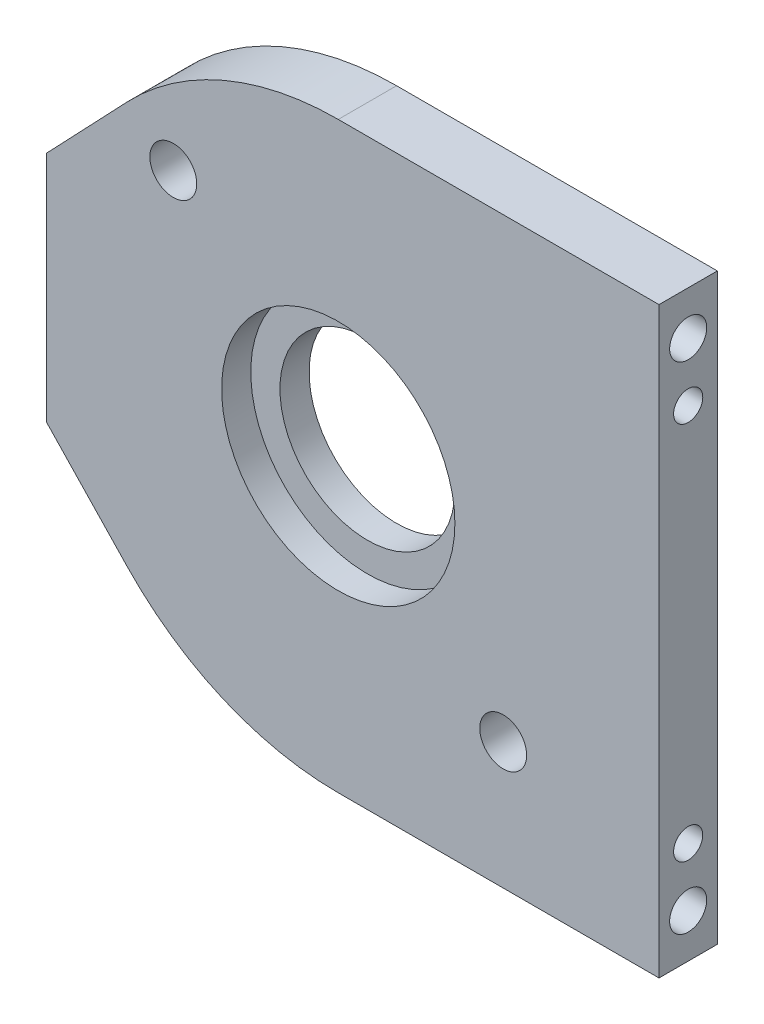
ISO-10303-21;
HEADER;
FILE_DESCRIPTION(('STEP AP214'),'2;1');
FILE_NAME('part.step','',(''),(''),'','','');
FILE_SCHEMA(('AUTOMOTIVE_DESIGN { 1 0 10303 214 1 1 1 1 }'));
ENDSEC;
DATA;
#1=APPLICATION_CONTEXT('core data for automotive mechanical design processes');
#2=APPLICATION_PROTOCOL_DEFINITION('international standard','automotive_design',2000,#1);
#3=PRODUCT_CONTEXT('',#1,'mechanical');
#4=PRODUCT('Part','Part','',(#3));
#5=PRODUCT_RELATED_PRODUCT_CATEGORY('part','',(#4));
#6=PRODUCT_DEFINITION_FORMATION('','',#4);
#7=PRODUCT_DEFINITION_CONTEXT('part definition',#1,'design');
#8=PRODUCT_DEFINITION('design','',#6,#7);
#9=PRODUCT_DEFINITION_SHAPE('','',#8);
#10=(LENGTH_UNIT() NAMED_UNIT(*) SI_UNIT(.MILLI.,.METRE.));
#11=(NAMED_UNIT(*) PLANE_ANGLE_UNIT() SI_UNIT($,.RADIAN.));
#12=(NAMED_UNIT(*) SI_UNIT($,.STERADIAN.) SOLID_ANGLE_UNIT());
#13=UNCERTAINTY_MEASURE_WITH_UNIT(LENGTH_MEASURE(1.E-05),#10,'distance_accuracy_value','');
#14=(GEOMETRIC_REPRESENTATION_CONTEXT(3) GLOBAL_UNCERTAINTY_ASSIGNED_CONTEXT((#13)) GLOBAL_UNIT_ASSIGNED_CONTEXT((#10,
#11,#12)) REPRESENTATION_CONTEXT('',''));
#15=CARTESIAN_POINT('',(0.,0.,0.));
#16=DIRECTION('',(0.,0.,1.));
#17=DIRECTION('',(1.,0.,0.));
#18=AXIS2_PLACEMENT_3D('',#15,#16,#17);
#19=CARTESIAN_POINT('',(0.,0.,6.35));
#20=DIRECTION('',(0.,0.,-1.));
#21=DIRECTION('',(-1.,0.,0.));
#22=AXIS2_PLACEMENT_3D('',#19,#20,#21);
#23=CYLINDRICAL_SURFACE('',#22,9.525);
#24=CARTESIAN_POINT('',(0.,0.,0.));
#25=DIRECTION('',(0.,0.,1.));
#26=DIRECTION('',(1.,0.,0.));
#27=AXIS2_PLACEMENT_3D('',#24,#25,#26);
#28=CIRCLE('',#27,9.525);
#29=CARTESIAN_POINT('',(9.525,0.,0.));
#30=VERTEX_POINT('',#29);
#31=EDGE_CURVE('E142',#30,#30,#28,.T.);
#32=ORIENTED_EDGE('',*,*,#31,.F.);
#33=EDGE_LOOP('',(#32));
#34=FACE_BOUND('',#33,.T.);
#35=CARTESIAN_POINT('',(0.,0.,3.175));
#36=DIRECTION('',(0.,0.,1.));
#37=DIRECTION('',(1.,0.,0.));
#38=AXIS2_PLACEMENT_3D('',#35,#36,#37);
#39=CIRCLE('',#38,9.525);
#40=CARTESIAN_POINT('',(9.525,0.,3.175));
#41=VERTEX_POINT('',#40);
#42=EDGE_CURVE('E41',#41,#41,#39,.T.);
#43=ORIENTED_EDGE('',*,*,#42,.T.);
#44=EDGE_LOOP('',(#43));
#45=FACE_BOUND('',#44,.T.);
#46=ADVANCED_FACE('F37',(#34,#45),#23,.F.);
#47=CARTESIAN_POINT('',(0.,0.,6.35));
#48=DIRECTION('',(0.,0.,1.));
#49=DIRECTION('',(1.,0.,0.));
#50=AXIS2_PLACEMENT_3D('',#47,#48,#49);
#51=PLANE('',#50);
#52=CARTESIAN_POINT('',(0.,0.,6.35));
#53=DIRECTION('',(0.,0.,1.));
#54=DIRECTION('',(1.,0.,0.));
#55=AXIS2_PLACEMENT_3D('',#52,#53,#54);
#56=CIRCLE('',#55,12.7);
#57=CARTESIAN_POINT('',(12.7,0.,6.35));
#58=VERTEX_POINT('',#57);
#59=EDGE_CURVE('E214',#58,#58,#56,.T.);
#60=ORIENTED_EDGE('',*,*,#59,.F.);
#61=EDGE_LOOP('',(#60));
#62=FACE_BOUND('',#61,.T.);
#63=CARTESIAN_POINT('',(-17.9605122421383,17.9605122421383,6.35));
#64=DIRECTION('',(0.,0.,1.));
#65=DIRECTION('',(1.,0.,0.));
#66=AXIS2_PLACEMENT_3D('',#63,#64,#65);
#67=CIRCLE('',#66,2.55269999999999);
#68=CARTESIAN_POINT('',(-15.4078122421383,17.9605122421383,6.35));
#69=VERTEX_POINT('',#68);
#70=EDGE_CURVE('E199',#69,#69,#67,.T.);
#71=ORIENTED_EDGE('',*,*,#70,.F.);
#72=EDGE_LOOP('',(#71));
#73=FACE_BOUND('',#72,.T.);
#74=CARTESIAN_POINT('',(17.9605122421383,-17.9605122421383,6.35));
#75=DIRECTION('',(0.,0.,1.));
#76=DIRECTION('',(1.,0.,0.));
#77=AXIS2_PLACEMENT_3D('',#74,#75,#76);
#78=CIRCLE('',#77,2.55269999999999);
#79=CARTESIAN_POINT('',(20.5132122421383,-17.9605122421383,6.35));
#80=VERTEX_POINT('',#79);
#81=EDGE_CURVE('E193',#80,#80,#78,.T.);
#82=ORIENTED_EDGE('',*,*,#81,.F.);
#83=EDGE_LOOP('',(#82));
#84=FACE_BOUND('',#83,.T.);
#85=CARTESIAN_POINT('',(0.,0.,6.35));
#86=DIRECTION('',(0.,0.,1.));
#87=DIRECTION('',(1.,0.,0.));
#88=AXIS2_PLACEMENT_3D('',#85,#86,#87);
#89=CIRCLE('',#88,31.75);
#90=CARTESIAN_POINT('',(0.,31.75,6.35));
#91=VERTEX_POINT('',#90);
#92=CARTESIAN_POINT('',(-22.9913793103449,21.8965517241379,6.35));
#93=VERTEX_POINT('',#92);
#94=EDGE_CURVE('E153',#91,#93,#89,.T.);
#95=ORIENTED_EDGE('',*,*,#94,.T.);
#96=DIRECTION('',(-0.689655172413792,-0.724137931034483,0.));
#97=VECTOR('',#96,1.);
#98=CARTESIAN_POINT('',(-22.9913793103449,21.8965517241379,6.35));
#99=LINE('',#98,#97);
#100=CARTESIAN_POINT('',(-31.75,12.7,6.35));
#101=VERTEX_POINT('',#100);
#102=EDGE_CURVE('E99',#93,#101,#99,.T.);
#103=ORIENTED_EDGE('',*,*,#102,.T.);
#104=DIRECTION('',(0.,-1.,0.));
#105=VECTOR('',#104,1.);
#106=CARTESIAN_POINT('',(-31.75,12.7,6.35));
#107=LINE('',#106,#105);
#108=CARTESIAN_POINT('',(-31.75,-12.7,6.35));
#109=VERTEX_POINT('',#108);
#110=EDGE_CURVE('E169',#101,#109,#107,.T.);
#111=ORIENTED_EDGE('',*,*,#110,.T.);
#112=DIRECTION('',(0.689655172413793,-0.724137931034483,0.));
#113=VECTOR('',#112,1.);
#114=CARTESIAN_POINT('',(-31.75,-12.7,6.35));
#115=LINE('',#114,#113);
#116=CARTESIAN_POINT('',(-22.9913793103448,-21.8965517241379,6.35));
#117=VERTEX_POINT('',#116);
#118=EDGE_CURVE('E182',#109,#117,#115,.T.);
#119=ORIENTED_EDGE('',*,*,#118,.T.);
#120=CARTESIAN_POINT('',(0.,0.,6.35));
#121=DIRECTION('',(0.,0.,1.));
#122=DIRECTION('',(1.,0.,0.));
#123=AXIS2_PLACEMENT_3D('',#120,#121,#122);
#124=CIRCLE('',#123,31.75);
#125=CARTESIAN_POINT('',(0.,-31.75,6.35));
#126=VERTEX_POINT('',#125);
#127=EDGE_CURVE('E120',#117,#126,#124,.T.);
#128=ORIENTED_EDGE('',*,*,#127,.T.);
#129=DIRECTION('',(1.,0.,0.));
#130=VECTOR('',#129,1.);
#131=CARTESIAN_POINT('',(34.925,-31.75,6.35));
#132=LINE('',#131,#130);
#133=CARTESIAN_POINT('',(34.925,-31.75,6.35));
#134=VERTEX_POINT('',#133);
#135=EDGE_CURVE('E114',#126,#134,#132,.T.);
#136=ORIENTED_EDGE('',*,*,#135,.T.);
#137=DIRECTION('',(0.,1.,0.));
#138=VECTOR('',#137,1.);
#139=CARTESIAN_POINT('',(34.925,31.75,6.35));
#140=LINE('',#139,#138);
#141=CARTESIAN_POINT('',(34.925,31.75,6.35));
#142=VERTEX_POINT('',#141);
#143=EDGE_CURVE('E118',#134,#142,#140,.T.);
#144=ORIENTED_EDGE('',*,*,#143,.T.);
#145=DIRECTION('',(-1.,0.,0.));
#146=VECTOR('',#145,1.);
#147=CARTESIAN_POINT('',(34.925,31.75,6.35));
#148=LINE('',#147,#146);
#149=EDGE_CURVE('E55',#142,#91,#148,.T.);
#150=ORIENTED_EDGE('',*,*,#149,.T.);
#151=EDGE_LOOP('',(#95,#103,#111,#119,#128,#136,#144,#150));
#152=FACE_BOUND('',#151,.T.);
#153=ADVANCED_FACE('F116',(#62,#73,#84,#152),#51,.T.);
#154=CARTESIAN_POINT('',(0.,0.,0.));
#155=DIRECTION('',(0.,0.,1.));
#156=DIRECTION('',(1.,0.,0.));
#157=AXIS2_PLACEMENT_3D('',#154,#155,#156);
#158=PLANE('',#157);
#159=CARTESIAN_POINT('',(-17.9605122421383,17.9605122421383,0.));
#160=DIRECTION('',(0.,0.,1.));
#161=DIRECTION('',(1.,0.,0.));
#162=AXIS2_PLACEMENT_3D('',#159,#160,#161);
#163=CIRCLE('',#162,2.5527);
#164=CARTESIAN_POINT('',(-15.4078122421383,17.9605122421383,0.));
#165=VERTEX_POINT('',#164);
#166=EDGE_CURVE('E196',#165,#165,#163,.T.);
#167=ORIENTED_EDGE('',*,*,#166,.T.);
#168=EDGE_LOOP('',(#167));
#169=FACE_BOUND('',#168,.T.);
#170=CARTESIAN_POINT('',(17.9605122421383,-17.9605122421383,0.));
#171=DIRECTION('',(0.,0.,1.));
#172=DIRECTION('',(1.,0.,0.));
#173=AXIS2_PLACEMENT_3D('',#170,#171,#172);
#174=CIRCLE('',#173,2.5527);
#175=CARTESIAN_POINT('',(20.5132122421383,-17.9605122421383,0.));
#176=VERTEX_POINT('',#175);
#177=EDGE_CURVE('E190',#176,#176,#174,.T.);
#178=ORIENTED_EDGE('',*,*,#177,.T.);
#179=EDGE_LOOP('',(#178));
#180=FACE_BOUND('',#179,.T.);
#181=CARTESIAN_POINT('',(0.,0.,0.));
#182=DIRECTION('',(0.,0.,1.));
#183=DIRECTION('',(1.,0.,0.));
#184=AXIS2_PLACEMENT_3D('',#181,#182,#183);
#185=CIRCLE('',#184,31.75);
#186=CARTESIAN_POINT('',(0.,31.75,0.));
#187=VERTEX_POINT('',#186);
#188=CARTESIAN_POINT('',(-22.9913793103449,21.8965517241379,0.));
#189=VERTEX_POINT('',#188);
#190=EDGE_CURVE('E138',#187,#189,#185,.T.);
#191=ORIENTED_EDGE('',*,*,#190,.F.);
#192=DIRECTION('',(-1.,0.,0.));
#193=VECTOR('',#192,1.);
#194=CARTESIAN_POINT('',(34.925,31.75,0.));
#195=LINE('',#194,#193);
#196=CARTESIAN_POINT('',(34.925,31.75,0.));
#197=VERTEX_POINT('',#196);
#198=EDGE_CURVE('E91',#197,#187,#195,.T.);
#199=ORIENTED_EDGE('',*,*,#198,.F.);
#200=DIRECTION('',(0.,1.,0.));
#201=VECTOR('',#200,1.);
#202=CARTESIAN_POINT('',(34.925,31.75,0.));
#203=LINE('',#202,#201);
#204=CARTESIAN_POINT('',(34.925,-31.75,0.));
#205=VERTEX_POINT('',#204);
#206=EDGE_CURVE('E85',#205,#197,#203,.T.);
#207=ORIENTED_EDGE('',*,*,#206,.F.);
#208=DIRECTION('',(1.,0.,0.));
#209=VECTOR('',#208,1.);
#210=CARTESIAN_POINT('',(34.925,-31.75,0.));
#211=LINE('',#210,#209);
#212=CARTESIAN_POINT('',(0.,-31.75,0.));
#213=VERTEX_POINT('',#212);
#214=EDGE_CURVE('E128',#213,#205,#211,.T.);
#215=ORIENTED_EDGE('',*,*,#214,.F.);
#216=CARTESIAN_POINT('',(0.,0.,0.));
#217=DIRECTION('',(0.,0.,1.));
#218=DIRECTION('',(1.,0.,0.));
#219=AXIS2_PLACEMENT_3D('',#216,#217,#218);
#220=CIRCLE('',#219,31.75);
#221=CARTESIAN_POINT('',(-22.9913793103448,-21.8965517241379,0.));
#222=VERTEX_POINT('',#221);
#223=EDGE_CURVE('E148',#222,#213,#220,.T.);
#224=ORIENTED_EDGE('',*,*,#223,.F.);
#225=DIRECTION('',(0.689655172413793,-0.724137931034483,0.));
#226=VECTOR('',#225,1.);
#227=CARTESIAN_POINT('',(-31.75,-12.7,0.));
#228=LINE('',#227,#226);
#229=CARTESIAN_POINT('',(-31.75,-12.7,0.));
#230=VERTEX_POINT('',#229);
#231=EDGE_CURVE('E146',#230,#222,#228,.T.);
#232=ORIENTED_EDGE('',*,*,#231,.F.);
#233=DIRECTION('',(0.,-1.,0.));
#234=VECTOR('',#233,1.);
#235=CARTESIAN_POINT('',(-31.75,12.7,0.));
#236=LINE('',#235,#234);
#237=CARTESIAN_POINT('',(-31.75,12.7,0.));
#238=VERTEX_POINT('',#237);
#239=EDGE_CURVE('E144',#238,#230,#236,.T.);
#240=ORIENTED_EDGE('',*,*,#239,.F.);
#241=DIRECTION('',(-0.689655172413792,-0.724137931034483,0.));
#242=VECTOR('',#241,1.);
#243=CARTESIAN_POINT('',(-22.9913793103449,21.8965517241379,0.));
#244=LINE('',#243,#242);
#245=EDGE_CURVE('E141',#189,#238,#244,.T.);
#246=ORIENTED_EDGE('',*,*,#245,.F.);
#247=EDGE_LOOP('',(#191,#199,#207,#215,#224,#232,#240,#246));
#248=FACE_BOUND('',#247,.T.);
#249=ORIENTED_EDGE('',*,*,#31,.T.);
#250=EDGE_LOOP('',(#249));
#251=FACE_BOUND('',#250,.T.);
#252=ADVANCED_FACE('F173',(#169,#180,#248,#251),#158,.F.);
#253=CARTESIAN_POINT('',(0.,0.,6.35));
#254=DIRECTION('',(0.,0.,-1.));
#255=DIRECTION('',(-1.,0.,0.));
#256=AXIS2_PLACEMENT_3D('',#253,#254,#255);
#257=CYLINDRICAL_SURFACE('',#256,31.75);
#258=ORIENTED_EDGE('',*,*,#190,.T.);
#259=DIRECTION('',(0.,0.,-1.));
#260=VECTOR('',#259,1.);
#261=CARTESIAN_POINT('',(-22.9913793103449,21.8965517241379,6.35));
#262=LINE('',#261,#260);
#263=EDGE_CURVE('E11',#93,#189,#262,.T.);
#264=ORIENTED_EDGE('',*,*,#263,.F.);
#265=ORIENTED_EDGE('',*,*,#94,.F.);
#266=DIRECTION('',(0.,0.,-1.));
#267=VECTOR('',#266,1.);
#268=CARTESIAN_POINT('',(0.,31.75,6.35));
#269=LINE('',#268,#267);
#270=EDGE_CURVE('E134',#91,#187,#269,.T.);
#271=ORIENTED_EDGE('',*,*,#270,.T.);
#272=EDGE_LOOP('',(#258,#264,#265,#271));
#273=FACE_BOUND('',#272,.T.);
#274=ADVANCED_FACE('F39',(#273),#257,.T.);
#275=CARTESIAN_POINT('',(-22.9913793103449,21.8965517241379,6.35));
#276=DIRECTION('',(0.724137931034483,-0.689655172413792,0.));
#277=DIRECTION('',(0.689655172413792,0.724137931034483,0.));
#278=AXIS2_PLACEMENT_3D('',#275,#276,#277);
#279=PLANE('',#278);
#280=ORIENTED_EDGE('',*,*,#245,.T.);
#281=DIRECTION('',(0.,0.,-1.));
#282=VECTOR('',#281,1.);
#283=CARTESIAN_POINT('',(-31.75,12.7,6.35));
#284=LINE('',#283,#282);
#285=EDGE_CURVE('E47',#101,#238,#284,.T.);
#286=ORIENTED_EDGE('',*,*,#285,.F.);
#287=ORIENTED_EDGE('',*,*,#102,.F.);
#288=ORIENTED_EDGE('',*,*,#263,.T.);
#289=EDGE_LOOP('',(#280,#286,#287,#288));
#290=FACE_BOUND('',#289,.T.);
#291=ADVANCED_FACE('F255',(#290),#279,.F.);
#292=CARTESIAN_POINT('',(-31.75,12.7,6.35));
#293=DIRECTION('',(1.,0.,0.));
#294=DIRECTION('',(0.,1.,0.));
#295=AXIS2_PLACEMENT_3D('',#292,#293,#294);
#296=PLANE('',#295);
#297=CARTESIAN_POINT('',(-31.75,0.,3.175));
#298=DIRECTION('',(-1.,0.,0.));
#299=DIRECTION('',(0.,0.,1.));
#300=AXIS2_PLACEMENT_3D('',#297,#298,#299);
#301=CIRCLE('',#300,2.0193);
#302=CARTESIAN_POINT('',(-31.75,0.,5.1943));
#303=VERTEX_POINT('',#302);
#304=EDGE_CURVE('E247',#303,#303,#301,.T.);
#305=ORIENTED_EDGE('',*,*,#304,.F.);
#306=EDGE_LOOP('',(#305));
#307=FACE_BOUND('',#306,.T.);
#308=CARTESIAN_POINT('',(-31.75,7.93749999999999,3.175));
#309=DIRECTION('',(-1.,0.,0.));
#310=DIRECTION('',(0.,0.,1.));
#311=AXIS2_PLACEMENT_3D('',#308,#309,#310);
#312=CIRCLE('',#311,1.5875);
#313=CARTESIAN_POINT('',(-31.75,7.93749999999999,4.7625));
#314=VERTEX_POINT('',#313);
#315=EDGE_CURVE('E241',#314,#314,#312,.T.);
#316=ORIENTED_EDGE('',*,*,#315,.F.);
#317=EDGE_LOOP('',(#316));
#318=FACE_BOUND('',#317,.T.);
#319=CARTESIAN_POINT('',(-31.75,-7.93750000000001,3.175));
#320=DIRECTION('',(-1.,0.,0.));
#321=DIRECTION('',(0.,0.,1.));
#322=AXIS2_PLACEMENT_3D('',#319,#320,#321);
#323=CIRCLE('',#322,1.5875);
#324=CARTESIAN_POINT('',(-31.75,-7.93750000000001,4.7625));
#325=VERTEX_POINT('',#324);
#326=EDGE_CURVE('E235',#325,#325,#323,.T.);
#327=ORIENTED_EDGE('',*,*,#326,.F.);
#328=EDGE_LOOP('',(#327));
#329=FACE_BOUND('',#328,.T.);
#330=ORIENTED_EDGE('',*,*,#239,.T.);
#331=DIRECTION('',(0.,0.,-1.));
#332=VECTOR('',#331,1.);
#333=CARTESIAN_POINT('',(-31.75,-12.7,6.35));
#334=LINE('',#333,#332);
#335=EDGE_CURVE('E160',#109,#230,#334,.T.);
#336=ORIENTED_EDGE('',*,*,#335,.F.);
#337=ORIENTED_EDGE('',*,*,#110,.F.);
#338=ORIENTED_EDGE('',*,*,#285,.T.);
#339=EDGE_LOOP('',(#330,#336,#337,#338));
#340=FACE_BOUND('',#339,.T.);
#341=ADVANCED_FACE('F167',(#307,#318,#329,#340),#296,.F.);
#342=CARTESIAN_POINT('',(-31.75,-12.7,6.35));
#343=DIRECTION('',(0.724137931034483,0.689655172413793,0.));
#344=DIRECTION('',(-0.689655172413793,0.724137931034483,0.));
#345=AXIS2_PLACEMENT_3D('',#342,#343,#344);
#346=PLANE('',#345);
#347=ORIENTED_EDGE('',*,*,#231,.T.);
#348=DIRECTION('',(0.,0.,-1.));
#349=VECTOR('',#348,1.);
#350=CARTESIAN_POINT('',(-22.9913793103448,-21.8965517241379,6.35));
#351=LINE('',#350,#349);
#352=EDGE_CURVE('E157',#117,#222,#351,.T.);
#353=ORIENTED_EDGE('',*,*,#352,.F.);
#354=ORIENTED_EDGE('',*,*,#118,.F.);
#355=ORIENTED_EDGE('',*,*,#335,.T.);
#356=EDGE_LOOP('',(#347,#353,#354,#355));
#357=FACE_BOUND('',#356,.T.);
#358=ADVANCED_FACE('F178',(#357),#346,.F.);
#359=CARTESIAN_POINT('',(0.,0.,6.35));
#360=DIRECTION('',(0.,0.,-1.));
#361=DIRECTION('',(-1.,0.,0.));
#362=AXIS2_PLACEMENT_3D('',#359,#360,#361);
#363=CYLINDRICAL_SURFACE('',#362,31.75);
#364=ORIENTED_EDGE('',*,*,#223,.T.);
#365=DIRECTION('',(0.,0.,-1.));
#366=VECTOR('',#365,1.);
#367=CARTESIAN_POINT('',(0.,-31.75,6.35));
#368=LINE('',#367,#366);
#369=EDGE_CURVE('E129',#126,#213,#368,.T.);
#370=ORIENTED_EDGE('',*,*,#369,.F.);
#371=ORIENTED_EDGE('',*,*,#127,.F.);
#372=ORIENTED_EDGE('',*,*,#352,.T.);
#373=EDGE_LOOP('',(#364,#370,#371,#372));
#374=FACE_BOUND('',#373,.T.);
#375=ADVANCED_FACE('F181',(#374),#363,.T.);
#376=CARTESIAN_POINT('',(34.925,-31.75,6.35));
#377=DIRECTION('',(0.,1.,0.));
#378=DIRECTION('',(-1.,0.,0.));
#379=AXIS2_PLACEMENT_3D('',#376,#377,#378);
#380=PLANE('',#379);
#381=ORIENTED_EDGE('',*,*,#214,.T.);
#382=DIRECTION('',(0.,0.,-1.));
#383=VECTOR('',#382,1.);
#384=CARTESIAN_POINT('',(34.925,-31.75,6.35));
#385=LINE('',#384,#383);
#386=EDGE_CURVE('E125',#134,#205,#385,.T.);
#387=ORIENTED_EDGE('',*,*,#386,.F.);
#388=ORIENTED_EDGE('',*,*,#135,.F.);
#389=ORIENTED_EDGE('',*,*,#369,.T.);
#390=EDGE_LOOP('',(#381,#387,#388,#389));
#391=FACE_BOUND('',#390,.T.);
#392=ADVANCED_FACE('F126',(#391),#380,.F.);
#393=CARTESIAN_POINT('',(34.925,31.75,6.35));
#394=DIRECTION('',(-1.,0.,0.));
#395=DIRECTION('',(0.,-1.,0.));
#396=AXIS2_PLACEMENT_3D('',#393,#394,#395);
#397=PLANE('',#396);
#398=CARTESIAN_POINT('',(34.925,26.9875,3.175));
#399=DIRECTION('',(1.,0.,0.));
#400=DIRECTION('',(0.,0.,-1.));
#401=AXIS2_PLACEMENT_3D('',#398,#399,#400);
#402=CIRCLE('',#401,2.0193);
#403=CARTESIAN_POINT('',(34.925,26.9875,1.1557));
#404=VERTEX_POINT('',#403);
#405=EDGE_CURVE('E229',#404,#404,#402,.T.);
#406=ORIENTED_EDGE('',*,*,#405,.F.);
#407=EDGE_LOOP('',(#406));
#408=FACE_BOUND('',#407,.T.);
#409=CARTESIAN_POINT('',(34.925,-26.9875,3.175));
#410=DIRECTION('',(1.,0.,0.));
#411=DIRECTION('',(0.,0.,-1.));
#412=AXIS2_PLACEMENT_3D('',#409,#410,#411);
#413=CIRCLE('',#412,2.0193);
#414=CARTESIAN_POINT('',(34.925,-26.9875,1.1557));
#415=VERTEX_POINT('',#414);
#416=EDGE_CURVE('E223',#415,#415,#413,.T.);
#417=ORIENTED_EDGE('',*,*,#416,.F.);
#418=EDGE_LOOP('',(#417));
#419=FACE_BOUND('',#418,.T.);
#420=CARTESIAN_POINT('',(34.925,20.6375,3.175));
#421=DIRECTION('',(1.,0.,0.));
#422=DIRECTION('',(0.,0.,-1.));
#423=AXIS2_PLACEMENT_3D('',#420,#421,#422);
#424=CIRCLE('',#423,1.58749999999999);
#425=CARTESIAN_POINT('',(34.925,20.6375,1.58750000000001));
#426=VERTEX_POINT('',#425);
#427=EDGE_CURVE('E211',#426,#426,#424,.T.);
#428=ORIENTED_EDGE('',*,*,#427,.F.);
#429=EDGE_LOOP('',(#428));
#430=FACE_BOUND('',#429,.T.);
#431=CARTESIAN_POINT('',(34.925,-20.6375,3.175));
#432=DIRECTION('',(1.,0.,0.));
#433=DIRECTION('',(0.,0.,-1.));
#434=AXIS2_PLACEMENT_3D('',#431,#432,#433);
#435=CIRCLE('',#434,1.58749999999999);
#436=CARTESIAN_POINT('',(34.925,-20.6375,1.58750000000001));
#437=VERTEX_POINT('',#436);
#438=EDGE_CURVE('E205',#437,#437,#435,.T.);
#439=ORIENTED_EDGE('',*,*,#438,.F.);
#440=EDGE_LOOP('',(#439));
#441=FACE_BOUND('',#440,.T.);
#442=ORIENTED_EDGE('',*,*,#206,.T.);
#443=DIRECTION('',(0.,0.,-1.));
#444=VECTOR('',#443,1.);
#445=CARTESIAN_POINT('',(34.925,31.75,6.35));
#446=LINE('',#445,#444);
#447=EDGE_CURVE('E130',#142,#197,#446,.T.);
#448=ORIENTED_EDGE('',*,*,#447,.F.);
#449=ORIENTED_EDGE('',*,*,#143,.F.);
#450=ORIENTED_EDGE('',*,*,#386,.T.);
#451=EDGE_LOOP('',(#442,#448,#449,#450));
#452=FACE_BOUND('',#451,.T.);
#453=ADVANCED_FACE('F132',(#408,#419,#430,#441,#452),#397,.F.);
#454=CARTESIAN_POINT('',(34.925,31.75,6.35));
#455=DIRECTION('',(0.,-1.,0.));
#456=DIRECTION('',(0.,0.,-1.));
#457=AXIS2_PLACEMENT_3D('',#454,#455,#456);
#458=PLANE('',#457);
#459=ORIENTED_EDGE('',*,*,#198,.T.);
#460=ORIENTED_EDGE('',*,*,#270,.F.);
#461=ORIENTED_EDGE('',*,*,#149,.F.);
#462=ORIENTED_EDGE('',*,*,#447,.T.);
#463=EDGE_LOOP('',(#459,#460,#461,#462));
#464=FACE_BOUND('',#463,.T.);
#465=ADVANCED_FACE('F295',(#464),#458,.F.);
#466=CARTESIAN_POINT('',(17.9605122421383,-17.9605122421383,6.35));
#467=DIRECTION('',(0.,0.,1.));
#468=DIRECTION('',(1.,0.,0.));
#469=AXIS2_PLACEMENT_3D('',#466,#467,#468);
#470=CYLINDRICAL_SURFACE('',#469,2.55269999999999);
#471=ORIENTED_EDGE('',*,*,#177,.F.);
#472=EDGE_LOOP('',(#471));
#473=FACE_BOUND('',#472,.T.);
#474=ORIENTED_EDGE('',*,*,#81,.T.);
#475=EDGE_LOOP('',(#474));
#476=FACE_BOUND('',#475,.T.);
#477=ADVANCED_FACE('F289',(#473,#476),#470,.F.);
#478=CARTESIAN_POINT('',(-17.9605122421383,17.9605122421383,6.35));
#479=DIRECTION('',(0.,0.,1.));
#480=DIRECTION('',(1.,0.,0.));
#481=AXIS2_PLACEMENT_3D('',#478,#479,#480);
#482=CYLINDRICAL_SURFACE('',#481,2.55269999999999);
#483=ORIENTED_EDGE('',*,*,#166,.F.);
#484=EDGE_LOOP('',(#483));
#485=FACE_BOUND('',#484,.T.);
#486=ORIENTED_EDGE('',*,*,#70,.T.);
#487=EDGE_LOOP('',(#486));
#488=FACE_BOUND('',#487,.T.);
#489=ADVANCED_FACE('F491',(#485,#488),#482,.F.);
#490=CARTESIAN_POINT('',(24.765,-20.6375,3.175));
#491=DIRECTION('',(1.,0.,0.));
#492=DIRECTION('',(0.,0.,-1.));
#493=AXIS2_PLACEMENT_3D('',#490,#491,#492);
#494=CONICAL_SURFACE('',#493,1.5875,1.02974425867665);
#495=CARTESIAN_POINT('',(23.8111337672938,-20.6375,3.175));
#496=VERTEX_POINT('',#495);
#497=VERTEX_LOOP('',#496);
#498=FACE_BOUND('',#497,.T.);
#499=CARTESIAN_POINT('',(24.765,-20.6375,3.175));
#500=DIRECTION('',(1.,0.,0.));
#501=DIRECTION('',(0.,0.,-1.));
#502=AXIS2_PLACEMENT_3D('',#499,#500,#501);
#503=CIRCLE('',#502,1.5875);
#504=CARTESIAN_POINT('',(24.765,-20.6375,1.5875));
#505=VERTEX_POINT('',#504);
#506=EDGE_CURVE('E202',#505,#505,#503,.T.);
#507=ORIENTED_EDGE('',*,*,#506,.T.);
#508=EDGE_LOOP('',(#507));
#509=FACE_BOUND('',#508,.T.);
#510=ADVANCED_FACE('F487',(#498,#509),#494,.F.);
#511=CARTESIAN_POINT('',(34.925,-20.6375,3.175));
#512=DIRECTION('',(1.,0.,0.));
#513=DIRECTION('',(0.,0.,-1.));
#514=AXIS2_PLACEMENT_3D('',#511,#512,#513);
#515=CYLINDRICAL_SURFACE('',#514,1.5875);
#516=ORIENTED_EDGE('',*,*,#506,.F.);
#517=EDGE_LOOP('',(#516));
#518=FACE_BOUND('',#517,.T.);
#519=ORIENTED_EDGE('',*,*,#438,.T.);
#520=EDGE_LOOP('',(#519));
#521=FACE_BOUND('',#520,.T.);
#522=ADVANCED_FACE('F490',(#518,#521),#515,.F.);
#523=CARTESIAN_POINT('',(24.765,20.6375,3.175));
#524=DIRECTION('',(1.,0.,0.));
#525=DIRECTION('',(0.,0.,-1.));
#526=AXIS2_PLACEMENT_3D('',#523,#524,#525);
#527=CONICAL_SURFACE('',#526,1.5875,1.02974425867665);
#528=CARTESIAN_POINT('',(23.8111337672937,20.6375,3.175));
#529=VERTEX_POINT('',#528);
#530=VERTEX_LOOP('',#529);
#531=FACE_BOUND('',#530,.T.);
#532=CARTESIAN_POINT('',(24.765,20.6375,3.175));
#533=DIRECTION('',(1.,0.,0.));
#534=DIRECTION('',(0.,0.,-1.));
#535=AXIS2_PLACEMENT_3D('',#532,#533,#534);
#536=CIRCLE('',#535,1.5875);
#537=CARTESIAN_POINT('',(24.765,20.6375,1.5875));
#538=VERTEX_POINT('',#537);
#539=EDGE_CURVE('E208',#538,#538,#536,.T.);
#540=ORIENTED_EDGE('',*,*,#539,.T.);
#541=EDGE_LOOP('',(#540));
#542=FACE_BOUND('',#541,.T.);
#543=ADVANCED_FACE('F497',(#531,#542),#527,.F.);
#544=CARTESIAN_POINT('',(34.925,20.6375,3.175));
#545=DIRECTION('',(1.,0.,0.));
#546=DIRECTION('',(0.,0.,-1.));
#547=AXIS2_PLACEMENT_3D('',#544,#545,#546);
#548=CYLINDRICAL_SURFACE('',#547,1.58749999999999);
#549=ORIENTED_EDGE('',*,*,#539,.F.);
#550=EDGE_LOOP('',(#549));
#551=FACE_BOUND('',#550,.T.);
#552=ORIENTED_EDGE('',*,*,#427,.T.);
#553=EDGE_LOOP('',(#552));
#554=FACE_BOUND('',#553,.T.);
#555=ADVANCED_FACE('F339',(#551,#554),#548,.F.);
#556=CARTESIAN_POINT('',(0.,0.,3.175));
#557=DIRECTION('',(0.,0.,1.));
#558=DIRECTION('',(1.,0.,0.));
#559=AXIS2_PLACEMENT_3D('',#556,#557,#558);
#560=CYLINDRICAL_SURFACE('',#559,12.7);
#561=CARTESIAN_POINT('',(0.,0.,3.175));
#562=DIRECTION('',(0.,0.,1.));
#563=DIRECTION('',(1.,0.,0.));
#564=AXIS2_PLACEMENT_3D('',#561,#562,#563);
#565=CIRCLE('',#564,12.7);
#566=CARTESIAN_POINT('',(12.7,0.,3.175));
#567=VERTEX_POINT('',#566);
#568=EDGE_CURVE('E217',#567,#567,#565,.T.);
#569=ORIENTED_EDGE('',*,*,#568,.F.);
#570=EDGE_LOOP('',(#569));
#571=FACE_BOUND('',#570,.T.);
#572=ORIENTED_EDGE('',*,*,#59,.T.);
#573=EDGE_LOOP('',(#572));
#574=FACE_BOUND('',#573,.T.);
#575=ADVANCED_FACE('F333',(#571,#574),#560,.F.);
#576=CARTESIAN_POINT('',(0.,0.,3.175));
#577=DIRECTION('',(0.,0.,1.));
#578=DIRECTION('',(1.,0.,0.));
#579=AXIS2_PLACEMENT_3D('',#576,#577,#578);
#580=PLANE('',#579);
#581=ORIENTED_EDGE('',*,*,#42,.F.);
#582=EDGE_LOOP('',(#581));
#583=FACE_BOUND('',#582,.T.);
#584=ORIENTED_EDGE('',*,*,#568,.T.);
#585=EDGE_LOOP('',(#584));
#586=FACE_BOUND('',#585,.T.);
#587=ADVANCED_FACE('F338',(#583,#586),#580,.T.);
#588=CARTESIAN_POINT('',(19.177,-26.9875,3.175));
#589=DIRECTION('',(1.,0.,0.));
#590=DIRECTION('',(0.,0.,-1.));
#591=AXIS2_PLACEMENT_3D('',#588,#589,#590);
#592=CONICAL_SURFACE('',#591,2.0193,1.02974425867665);
#593=CARTESIAN_POINT('',(17.9636821519977,-26.9875,3.175));
#594=VERTEX_POINT('',#593);
#595=VERTEX_LOOP('',#594);
#596=FACE_BOUND('',#595,.T.);
#597=CARTESIAN_POINT('',(19.177,-26.9875,3.175));
#598=DIRECTION('',(1.,0.,0.));
#599=DIRECTION('',(0.,0.,-1.));
#600=AXIS2_PLACEMENT_3D('',#597,#598,#599);
#601=CIRCLE('',#600,2.0193);
#602=CARTESIAN_POINT('',(19.177,-26.9875,1.1557));
#603=VERTEX_POINT('',#602);
#604=EDGE_CURVE('E218',#603,#603,#601,.T.);
#605=ORIENTED_EDGE('',*,*,#604,.T.);
#606=EDGE_LOOP('',(#605));
#607=FACE_BOUND('',#606,.T.);
#608=ADVANCED_FACE('F350',(#596,#607),#592,.F.);
#609=CARTESIAN_POINT('',(34.925,-26.9875,3.175));
#610=DIRECTION('',(1.,0.,0.));
#611=DIRECTION('',(0.,0.,-1.));
#612=AXIS2_PLACEMENT_3D('',#609,#610,#611);
#613=CYLINDRICAL_SURFACE('',#612,2.0193);
#614=ORIENTED_EDGE('',*,*,#604,.F.);
#615=EDGE_LOOP('',(#614));
#616=FACE_BOUND('',#615,.T.);
#617=ORIENTED_EDGE('',*,*,#416,.T.);
#618=EDGE_LOOP('',(#617));
#619=FACE_BOUND('',#618,.T.);
#620=ADVANCED_FACE('F368',(#616,#619),#613,.F.);
#621=CARTESIAN_POINT('',(19.177,26.9875,3.175));
#622=DIRECTION('',(1.,0.,0.));
#623=DIRECTION('',(0.,0.,-1.));
#624=AXIS2_PLACEMENT_3D('',#621,#622,#623);
#625=CONICAL_SURFACE('',#624,2.0193,1.02974425867665);
#626=CARTESIAN_POINT('',(17.9636821519976,26.9875,3.175));
#627=VERTEX_POINT('',#626);
#628=VERTEX_LOOP('',#627);
#629=FACE_BOUND('',#628,.T.);
#630=CARTESIAN_POINT('',(19.177,26.9875,3.175));
#631=DIRECTION('',(1.,0.,0.));
#632=DIRECTION('',(0.,0.,-1.));
#633=AXIS2_PLACEMENT_3D('',#630,#631,#632);
#634=CIRCLE('',#633,2.0193);
#635=CARTESIAN_POINT('',(19.177,26.9875,1.1557));
#636=VERTEX_POINT('',#635);
#637=EDGE_CURVE('E226',#636,#636,#634,.T.);
#638=ORIENTED_EDGE('',*,*,#637,.T.);
#639=EDGE_LOOP('',(#638));
#640=FACE_BOUND('',#639,.T.);
#641=ADVANCED_FACE('F379',(#629,#640),#625,.F.);
#642=CARTESIAN_POINT('',(34.925,26.9875,3.175));
#643=DIRECTION('',(1.,0.,0.));
#644=DIRECTION('',(0.,0.,-1.));
#645=AXIS2_PLACEMENT_3D('',#642,#643,#644);
#646=CYLINDRICAL_SURFACE('',#645,2.0193);
#647=ORIENTED_EDGE('',*,*,#637,.F.);
#648=EDGE_LOOP('',(#647));
#649=FACE_BOUND('',#648,.T.);
#650=ORIENTED_EDGE('',*,*,#405,.T.);
#651=EDGE_LOOP('',(#650));
#652=FACE_BOUND('',#651,.T.);
#653=ADVANCED_FACE('F274',(#649,#652),#646,.F.);
#654=CARTESIAN_POINT('',(-25.4,-7.93750000000001,3.175));
#655=DIRECTION('',(-1.,0.,0.));
#656=DIRECTION('',(0.,0.,1.));
#657=AXIS2_PLACEMENT_3D('',#654,#655,#656);
#658=CONICAL_SURFACE('',#657,1.5875,1.02974425867665);
#659=CARTESIAN_POINT('',(-24.4461337672937,-7.93750000000001,3.175));
#660=VERTEX_POINT('',#659);
#661=VERTEX_LOOP('',#660);
#662=FACE_BOUND('',#661,.T.);
#663=CARTESIAN_POINT('',(-25.4,-7.93750000000001,3.175));
#664=DIRECTION('',(-1.,0.,0.));
#665=DIRECTION('',(0.,0.,1.));
#666=AXIS2_PLACEMENT_3D('',#663,#664,#665);
#667=CIRCLE('',#666,1.5875);
#668=CARTESIAN_POINT('',(-25.4,-7.93750000000001,4.7625));
#669=VERTEX_POINT('',#668);
#670=EDGE_CURVE('E232',#669,#669,#667,.T.);
#671=ORIENTED_EDGE('',*,*,#670,.T.);
#672=EDGE_LOOP('',(#671));
#673=FACE_BOUND('',#672,.T.);
#674=ADVANCED_FACE('F264',(#662,#673),#658,.F.);
#675=CARTESIAN_POINT('',(-31.75,-7.93750000000001,3.175));
#676=DIRECTION('',(-1.,0.,0.));
#677=DIRECTION('',(0.,0.,1.));
#678=AXIS2_PLACEMENT_3D('',#675,#676,#677);
#679=CYLINDRICAL_SURFACE('',#678,1.5875);
#680=ORIENTED_EDGE('',*,*,#670,.F.);
#681=EDGE_LOOP('',(#680));
#682=FACE_BOUND('',#681,.T.);
#683=ORIENTED_EDGE('',*,*,#326,.T.);
#684=EDGE_LOOP('',(#683));
#685=FACE_BOUND('',#684,.T.);
#686=ADVANCED_FACE('F261',(#682,#685),#679,.F.);
#687=CARTESIAN_POINT('',(-25.4,7.93749999999999,3.175));
#688=DIRECTION('',(-1.,0.,0.));
#689=DIRECTION('',(0.,0.,1.));
#690=AXIS2_PLACEMENT_3D('',#687,#688,#689);
#691=CONICAL_SURFACE('',#690,1.5875,1.02974425867665);
#692=CARTESIAN_POINT('',(-24.4461337672937,7.93749999999999,3.175));
#693=VERTEX_POINT('',#692);
#694=VERTEX_LOOP('',#693);
#695=FACE_BOUND('',#694,.T.);
#696=CARTESIAN_POINT('',(-25.4,7.93749999999999,3.175));
#697=DIRECTION('',(-1.,0.,0.));
#698=DIRECTION('',(0.,0.,1.));
#699=AXIS2_PLACEMENT_3D('',#696,#697,#698);
#700=CIRCLE('',#699,1.5875);
#701=CARTESIAN_POINT('',(-25.4,7.93749999999999,4.7625));
#702=VERTEX_POINT('',#701);
#703=EDGE_CURVE('E238',#702,#702,#700,.T.);
#704=ORIENTED_EDGE('',*,*,#703,.T.);
#705=EDGE_LOOP('',(#704));
#706=FACE_BOUND('',#705,.T.);
#707=ADVANCED_FACE('F263',(#695,#706),#691,.F.);
#708=CARTESIAN_POINT('',(-31.75,7.93749999999999,3.175));
#709=DIRECTION('',(-1.,0.,0.));
#710=DIRECTION('',(0.,0.,1.));
#711=AXIS2_PLACEMENT_3D('',#708,#709,#710);
#712=CYLINDRICAL_SURFACE('',#711,1.5875);
#713=ORIENTED_EDGE('',*,*,#703,.F.);
#714=EDGE_LOOP('',(#713));
#715=FACE_BOUND('',#714,.T.);
#716=ORIENTED_EDGE('',*,*,#315,.T.);
#717=EDGE_LOOP('',(#716));
#718=FACE_BOUND('',#717,.T.);
#719=ADVANCED_FACE('F271',(#715,#718),#712,.F.);
#720=CARTESIAN_POINT('',(-16.002,0.,3.175));
#721=DIRECTION('',(-1.,0.,0.));
#722=DIRECTION('',(0.,0.,1.));
#723=AXIS2_PLACEMENT_3D('',#720,#721,#722);
#724=CONICAL_SURFACE('',#723,2.0193,1.02974425867665);
#725=CARTESIAN_POINT('',(-14.7886821519977,0.,3.175));
#726=VERTEX_POINT('',#725);
#727=VERTEX_LOOP('',#726);
#728=FACE_BOUND('',#727,.T.);
#729=CARTESIAN_POINT('',(-16.002,0.,3.175));
#730=DIRECTION('',(-1.,0.,0.));
#731=DIRECTION('',(0.,0.,1.));
#732=AXIS2_PLACEMENT_3D('',#729,#730,#731);
#733=CIRCLE('',#732,2.0193);
#734=CARTESIAN_POINT('',(-16.002,0.,5.19429999999999));
#735=VERTEX_POINT('',#734);
#736=EDGE_CURVE('E244',#735,#735,#733,.T.);
#737=ORIENTED_EDGE('',*,*,#736,.T.);
#738=EDGE_LOOP('',(#737));
#739=FACE_BOUND('',#738,.T.);
#740=ADVANCED_FACE('F427',(#728,#739),#724,.F.);
#741=CARTESIAN_POINT('',(-31.75,0.,3.175));
#742=DIRECTION('',(-1.,0.,0.));
#743=DIRECTION('',(0.,0.,1.));
#744=AXIS2_PLACEMENT_3D('',#741,#742,#743);
#745=CYLINDRICAL_SURFACE('',#744,2.0193);
#746=ORIENTED_EDGE('',*,*,#736,.F.);
#747=EDGE_LOOP('',(#746));
#748=FACE_BOUND('',#747,.T.);
#749=ORIENTED_EDGE('',*,*,#304,.T.);
#750=EDGE_LOOP('',(#749));
#751=FACE_BOUND('',#750,.T.);
#752=ADVANCED_FACE('F251',(#748,#751),#745,.F.);
#753=CLOSED_SHELL('',(#46,#153,#252,#274,#291,#341,#358,#375,#392,#453,#465,#477,#489,#510,#522,
#543,#555,#575,#587,#608,#620,#641,#653,#674,#686,#707,#719,#740,#752));
#754=MANIFOLD_SOLID_BREP('B2',#753);
#755=ADVANCED_BREP_SHAPE_REPRESENTATION('',(#18,#754),#14);
#756=SHAPE_DEFINITION_REPRESENTATION(#9,#755);
ENDSEC;
END-ISO-10303-21;
